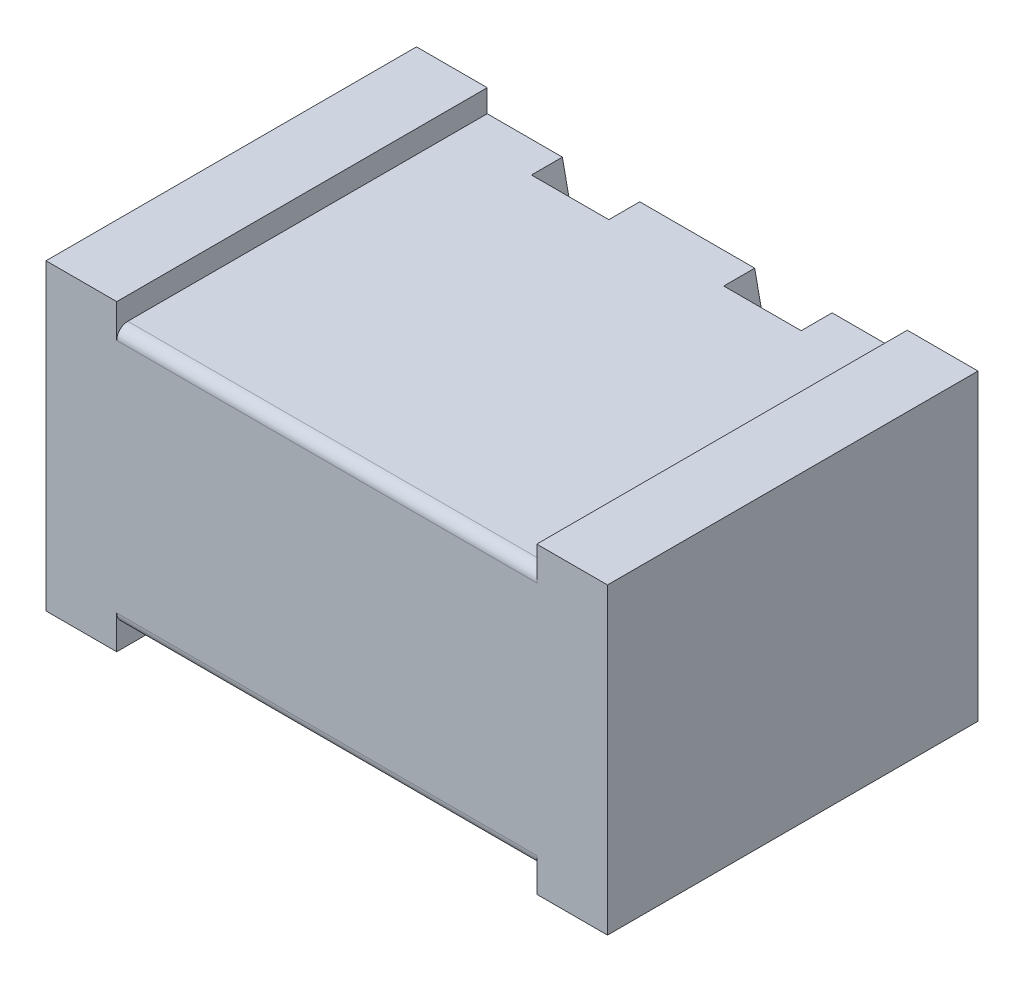
ISO-10303-21;
HEADER;
FILE_DESCRIPTION(('STEP AP214'),'2;1');
FILE_NAME('part.step','',(''),(''),'','','');
FILE_SCHEMA(('AUTOMOTIVE_DESIGN { 1 0 10303 214 1 1 1 1 }'));
ENDSEC;
DATA;
#1=APPLICATION_CONTEXT('core data for automotive mechanical design processes');
#2=APPLICATION_PROTOCOL_DEFINITION('international standard','automotive_design',2000,#1);
#3=PRODUCT_CONTEXT('',#1,'mechanical');
#4=PRODUCT('Part','Part','',(#3));
#5=PRODUCT_RELATED_PRODUCT_CATEGORY('part','',(#4));
#6=PRODUCT_DEFINITION_FORMATION('','',#4);
#7=PRODUCT_DEFINITION_CONTEXT('part definition',#1,'design');
#8=PRODUCT_DEFINITION('design','',#6,#7);
#9=PRODUCT_DEFINITION_SHAPE('','',#8);
#10=(LENGTH_UNIT() NAMED_UNIT(*) SI_UNIT(.MILLI.,.METRE.));
#11=(NAMED_UNIT(*) PLANE_ANGLE_UNIT() SI_UNIT($,.RADIAN.));
#12=(NAMED_UNIT(*) SI_UNIT($,.STERADIAN.) SOLID_ANGLE_UNIT());
#13=UNCERTAINTY_MEASURE_WITH_UNIT(LENGTH_MEASURE(1.E-05),#10,'distance_accuracy_value','');
#14=(GEOMETRIC_REPRESENTATION_CONTEXT(3) GLOBAL_UNCERTAINTY_ASSIGNED_CONTEXT((#13)) GLOBAL_UNIT_ASSIGNED_CONTEXT((#10,
#11,#12)) REPRESENTATION_CONTEXT('',''));
#15=CARTESIAN_POINT('',(0.,0.,0.));
#16=DIRECTION('',(0.,0.,1.));
#17=DIRECTION('',(1.,0.,0.));
#18=AXIS2_PLACEMENT_3D('',#15,#16,#17);
#19=CARTESIAN_POINT('',(2.37499999999999,-2.67,8.13));
#20=DIRECTION('',(-1.,0.,0.));
#21=DIRECTION('',(0.,-1.,0.));
#22=AXIS2_PLACEMENT_3D('',#19,#20,#21);
#23=CYLINDRICAL_SURFACE('',#22,0.25);
#24=CARTESIAN_POINT('',(-4.74999999999999,-2.67000000000001,8.13));
#25=DIRECTION('',(-1.,0.,0.));
#26=DIRECTION('',(0.,-1.,0.));
#27=AXIS2_PLACEMENT_3D('',#24,#25,#26);
#28=CIRCLE('',#27,0.25);
#29=CARTESIAN_POINT('',(-4.74999999999999,-2.91999999999999,8.13));
#30=VERTEX_POINT('',#29);
#31=CARTESIAN_POINT('',(-4.74999999999999,-2.67000000000001,8.38));
#32=VERTEX_POINT('',#31);
#33=EDGE_CURVE('E19',#30,#32,#28,.T.);
#34=ORIENTED_EDGE('',*,*,#33,.F.);
#35=DIRECTION('',(1.,0.,0.));
#36=VECTOR('',#35,1.);
#37=CARTESIAN_POINT('',(4.74999999999998,-2.91999999999999,8.13));
#38=LINE('',#37,#36);
#39=CARTESIAN_POINT('',(4.74999999999998,-2.91999999999999,8.13));
#40=VERTEX_POINT('',#39);
#41=EDGE_CURVE('E202',#40,#30,#38,.F.);
#42=ORIENTED_EDGE('',*,*,#41,.F.);
#43=CARTESIAN_POINT('',(4.74999999999998,-2.66999999999999,8.13));
#44=DIRECTION('',(-1.,0.,0.));
#45=DIRECTION('',(0.,-1.,0.));
#46=AXIS2_PLACEMENT_3D('',#43,#44,#45);
#47=CIRCLE('',#46,0.25);
#48=CARTESIAN_POINT('',(4.74999999999998,-2.67,8.38));
#49=VERTEX_POINT('',#48);
#50=EDGE_CURVE('E209',#49,#40,#47,.F.);
#51=ORIENTED_EDGE('',*,*,#50,.F.);
#52=DIRECTION('',(1.,0.,0.));
#53=VECTOR('',#52,1.);
#54=CARTESIAN_POINT('',(0.,-2.67000000000001,8.38));
#55=LINE('',#54,#53);
#56=EDGE_CURVE('E205',#32,#49,#55,.T.);
#57=ORIENTED_EDGE('',*,*,#56,.F.);
#58=EDGE_LOOP('',(#34,#42,#51,#57));
#59=FACE_BOUND('',#58,.T.);
#60=ADVANCED_FACE('F16',(#59),#23,.T.);
#61=CARTESIAN_POINT('',(-4.74999999999999,-2.92000000000001,0.));
#62=DIRECTION('',(1.,0.,0.));
#63=DIRECTION('',(0.,0.,-1.));
#64=AXIS2_PLACEMENT_3D('',#61,#62,#63);
#65=PLANE('',#64);
#66=DIRECTION('',(0.,0.,-1.));
#67=VECTOR('',#66,1.);
#68=CARTESIAN_POINT('',(-4.74999999999999,-2.91999999999999,0.));
#69=LINE('',#68,#67);
#70=CARTESIAN_POINT('',(-4.74999999999999,-2.92,0.));
#71=VERTEX_POINT('',#70);
#72=EDGE_CURVE('E212',#30,#71,#69,.T.);
#73=ORIENTED_EDGE('',*,*,#72,.F.);
#74=ORIENTED_EDGE('',*,*,#33,.T.);
#75=DIRECTION('',(0.,1.,0.));
#76=VECTOR('',#75,1.);
#77=CARTESIAN_POINT('',(-4.74999999999999,0.,8.38));
#78=LINE('',#77,#76);
#79=CARTESIAN_POINT('',(-4.74999999999999,-3.43,8.38));
#80=VERTEX_POINT('',#79);
#81=EDGE_CURVE('E269',#80,#32,#78,.T.);
#82=ORIENTED_EDGE('',*,*,#81,.F.);
#83=DIRECTION('',(0.,0.,-1.));
#84=VECTOR('',#83,1.);
#85=CARTESIAN_POINT('',(-4.74999999999999,-3.43,0.));
#86=LINE('',#85,#84);
#87=CARTESIAN_POINT('',(-4.74999999999999,-3.43,0.));
#88=VERTEX_POINT('',#87);
#89=EDGE_CURVE('E288',#88,#80,#86,.F.);
#90=ORIENTED_EDGE('',*,*,#89,.F.);
#91=DIRECTION('',(0.,1.,0.));
#92=VECTOR('',#91,1.);
#93=CARTESIAN_POINT('',(-4.74999999999999,-2.92000000000001,0.));
#94=LINE('',#93,#92);
#95=EDGE_CURVE('E210',#88,#71,#94,.T.);
#96=ORIENTED_EDGE('',*,*,#95,.T.);
#97=EDGE_LOOP('',(#73,#74,#82,#90,#96));
#98=FACE_BOUND('',#97,.T.);
#99=ADVANCED_FACE('F213',(#98),#65,.T.);
#100=CARTESIAN_POINT('',(4.74999999999999,-3.42999999999999,0.));
#101=DIRECTION('',(-1.,0.,0.));
#102=DIRECTION('',(0.,0.,1.));
#103=AXIS2_PLACEMENT_3D('',#100,#101,#102);
#104=PLANE('',#103);
#105=DIRECTION('',(0.,1.,0.));
#106=VECTOR('',#105,1.);
#107=CARTESIAN_POINT('',(4.74999999999999,-3.42999999999999,0.));
#108=LINE('',#107,#106);
#109=CARTESIAN_POINT('',(4.74999999999999,-2.91999999999999,0.));
#110=VERTEX_POINT('',#109);
#111=CARTESIAN_POINT('',(4.74999999999999,-3.42999999999999,0.));
#112=VERTEX_POINT('',#111);
#113=EDGE_CURVE('E237',#110,#112,#108,.F.);
#114=ORIENTED_EDGE('',*,*,#113,.T.);
#115=DIRECTION('',(0.,0.,-1.));
#116=VECTOR('',#115,1.);
#117=CARTESIAN_POINT('',(4.74999999999999,-3.42999999999999,0.));
#118=LINE('',#117,#116);
#119=CARTESIAN_POINT('',(4.74999999999998,-3.42999999999999,8.38));
#120=VERTEX_POINT('',#119);
#121=EDGE_CURVE('E278',#120,#112,#118,.T.);
#122=ORIENTED_EDGE('',*,*,#121,.F.);
#123=DIRECTION('',(0.,1.,0.));
#124=VECTOR('',#123,1.);
#125=CARTESIAN_POINT('',(4.74999999999998,0.,8.38));
#126=LINE('',#125,#124);
#127=EDGE_CURVE('E268',#49,#120,#126,.F.);
#128=ORIENTED_EDGE('',*,*,#127,.F.);
#129=ORIENTED_EDGE('',*,*,#50,.T.);
#130=DIRECTION('',(0.,0.,-1.));
#131=VECTOR('',#130,1.);
#132=CARTESIAN_POINT('',(4.74999999999998,-2.91999999999999,0.));
#133=LINE('',#132,#131);
#134=EDGE_CURVE('E223',#110,#40,#133,.F.);
#135=ORIENTED_EDGE('',*,*,#134,.F.);
#136=EDGE_LOOP('',(#114,#122,#128,#129,#135));
#137=FACE_BOUND('',#136,.T.);
#138=ADVANCED_FACE('F347',(#137),#104,.T.);
#139=CARTESIAN_POINT('',(2.175,-2.34385391106059,0.7));
#140=DIRECTION('',(0.,0.,1.));
#141=DIRECTION('',(1.,0.,0.));
#142=AXIS2_PLACEMENT_3D('',#139,#140,#141);
#143=PLANE('',#142);
#144=DIRECTION('',(-0.20271265834639,-0.979238264237126,0.));
#145=VECTOR('',#144,1.);
#146=CARTESIAN_POINT('',(1.30000000000001,-2.92,0.7));
#147=LINE('',#146,#145);
#148=CARTESIAN_POINT('',(1.30000000000001,-2.92,0.7));
#149=VERTEX_POINT('',#148);
#150=CARTESIAN_POINT('',(1.4854453223527,-2.02417456387338,0.7));
#151=VERTEX_POINT('',#150);
#152=EDGE_CURVE('E396',#149,#151,#147,.F.);
#153=ORIENTED_EDGE('',*,*,#152,.T.);
#154=CARTESIAN_POINT('',(2.17499999999999,-2.16691966165606,0.7));
#155=DIRECTION('',(0.,0.,1.));
#156=DIRECTION('',(1.,0.,0.));
#157=AXIS2_PLACEMENT_3D('',#154,#155,#156);
#158=CIRCLE('',#157,0.704174563873369);
#159=CARTESIAN_POINT('',(2.86455467764727,-2.02417456387336,0.7));
#160=VERTEX_POINT('',#159);
#161=EDGE_CURVE('E341',#151,#160,#158,.F.);
#162=ORIENTED_EDGE('',*,*,#161,.T.);
#163=DIRECTION('',(-0.202712658346438,0.979238264237116,0.));
#164=VECTOR('',#163,1.);
#165=CARTESIAN_POINT('',(3.05000000000001,-2.92,0.7));
#166=LINE('',#165,#164);
#167=CARTESIAN_POINT('',(3.05000000000001,-2.92,0.7));
#168=VERTEX_POINT('',#167);
#169=EDGE_CURVE('E239',#168,#160,#166,.T.);
#170=ORIENTED_EDGE('',*,*,#169,.F.);
#171=DIRECTION('',(1.,0.,0.));
#172=VECTOR('',#171,1.);
#173=CARTESIAN_POINT('',(4.74999999999998,-2.91999999999999,0.7));
#174=LINE('',#173,#172);
#175=EDGE_CURVE('E371',#149,#168,#174,.T.);
#176=ORIENTED_EDGE('',*,*,#175,.F.);
#177=EDGE_LOOP('',(#153,#162,#170,#176));
#178=FACE_BOUND('',#177,.T.);
#179=ADVANCED_FACE('F587',(#178),#143,.F.);
#180=CARTESIAN_POINT('',(6.34999999999999,-3.42999999999999,0.));
#181=DIRECTION('',(0.,-1.,0.));
#182=DIRECTION('',(0.,0.,-1.));
#183=AXIS2_PLACEMENT_3D('',#180,#181,#182);
#184=PLANE('',#183);
#185=DIRECTION('',(1.,0.,0.));
#186=VECTOR('',#185,1.);
#187=CARTESIAN_POINT('',(6.34999999999999,-3.42999999999999,0.));
#188=LINE('',#187,#186);
#189=CARTESIAN_POINT('',(6.34999999999999,-3.42999999999999,0.));
#190=VERTEX_POINT('',#189);
#191=EDGE_CURVE('E281',#112,#190,#188,.T.);
#192=ORIENTED_EDGE('',*,*,#191,.T.);
#193=DIRECTION('',(0.,0.,-1.));
#194=VECTOR('',#193,1.);
#195=CARTESIAN_POINT('',(6.34999999999999,-3.42999999999999,0.));
#196=LINE('',#195,#194);
#197=CARTESIAN_POINT('',(6.34999999999999,-3.42999999999999,8.38));
#198=VERTEX_POINT('',#197);
#199=EDGE_CURVE('E251',#198,#190,#196,.T.);
#200=ORIENTED_EDGE('',*,*,#199,.F.);
#201=DIRECTION('',(1.,0.,0.));
#202=VECTOR('',#201,1.);
#203=CARTESIAN_POINT('',(0.,-3.42999999999999,8.38));
#204=LINE('',#203,#202);
#205=EDGE_CURVE('E272',#120,#198,#204,.T.);
#206=ORIENTED_EDGE('',*,*,#205,.F.);
#207=ORIENTED_EDGE('',*,*,#121,.T.);
#208=EDGE_LOOP('',(#192,#200,#206,#207));
#209=FACE_BOUND('',#208,.T.);
#210=ADVANCED_FACE('F589',(#209),#184,.T.);
#211=CARTESIAN_POINT('',(-4.74999999999999,-3.43,0.));
#212=DIRECTION('',(0.,-1.,0.));
#213=DIRECTION('',(0.,0.,-1.));
#214=AXIS2_PLACEMENT_3D('',#211,#212,#213);
#215=PLANE('',#214);
#216=DIRECTION('',(1.,0.,0.));
#217=VECTOR('',#216,1.);
#218=CARTESIAN_POINT('',(-4.74999999999999,-3.43,0.));
#219=LINE('',#218,#217);
#220=CARTESIAN_POINT('',(-6.34999999999999,-3.43,0.));
#221=VERTEX_POINT('',#220);
#222=EDGE_CURVE('E291',#221,#88,#219,.T.);
#223=ORIENTED_EDGE('',*,*,#222,.T.);
#224=ORIENTED_EDGE('',*,*,#89,.T.);
#225=DIRECTION('',(1.,0.,0.));
#226=VECTOR('',#225,1.);
#227=CARTESIAN_POINT('',(0.,-3.43,8.38));
#228=LINE('',#227,#226);
#229=CARTESIAN_POINT('',(-6.34999999999999,-3.43,8.38));
#230=VERTEX_POINT('',#229);
#231=EDGE_CURVE('E285',#230,#80,#228,.T.);
#232=ORIENTED_EDGE('',*,*,#231,.F.);
#233=DIRECTION('',(0.,0.,1.));
#234=VECTOR('',#233,1.);
#235=CARTESIAN_POINT('',(-6.34999999999999,-3.43,0.));
#236=LINE('',#235,#234);
#237=EDGE_CURVE('E357',#221,#230,#236,.T.);
#238=ORIENTED_EDGE('',*,*,#237,.F.);
#239=EDGE_LOOP('',(#223,#224,#232,#238));
#240=FACE_BOUND('',#239,.T.);
#241=ADVANCED_FACE('F355',(#240),#215,.T.);
#242=CARTESIAN_POINT('',(-2.17499999999993,-2.34385391106058,0.7));
#243=DIRECTION('',(0.,0.,1.));
#244=DIRECTION('',(1.,0.,0.));
#245=AXIS2_PLACEMENT_3D('',#242,#243,#244);
#246=PLANE('',#245);
#247=DIRECTION('',(-0.202712658346663,-0.97923826423707,0.));
#248=VECTOR('',#247,1.);
#249=CARTESIAN_POINT('',(-3.05000000000002,-2.91999999999989,0.7));
#250=LINE('',#249,#248);
#251=CARTESIAN_POINT('',(-3.05000000000002,-2.91999999999993,0.7));
#252=VERTEX_POINT('',#251);
#253=CARTESIAN_POINT('',(-2.86455467764709,-2.02417456387337,0.7));
#254=VERTEX_POINT('',#253);
#255=EDGE_CURVE('E448',#252,#254,#250,.F.);
#256=ORIENTED_EDGE('',*,*,#255,.T.);
#257=CARTESIAN_POINT('',(-2.17499999999982,-2.16691966165614,0.7));
#258=DIRECTION('',(0.,0.,1.));
#259=DIRECTION('',(1.,0.,0.));
#260=AXIS2_PLACEMENT_3D('',#257,#258,#259);
#261=CIRCLE('',#260,0.704174563873369);
#262=CARTESIAN_POINT('',(-1.48544532235266,-2.02417456387341,0.7));
#263=VERTEX_POINT('',#262);
#264=EDGE_CURVE('E336',#254,#263,#261,.F.);
#265=ORIENTED_EDGE('',*,*,#264,.T.);
#266=DIRECTION('',(-0.202712658346356,0.979238264237133,0.));
#267=VECTOR('',#266,1.);
#268=CARTESIAN_POINT('',(-1.30000000000002,-2.91999999999996,0.7));
#269=LINE('',#268,#267);
#270=CARTESIAN_POINT('',(-1.30000000000002,-2.91999999999995,0.7));
#271=VERTEX_POINT('',#270);
#272=EDGE_CURVE('E290',#271,#263,#269,.T.);
#273=ORIENTED_EDGE('',*,*,#272,.F.);
#274=DIRECTION('',(1.,0.,0.));
#275=VECTOR('',#274,1.);
#276=CARTESIAN_POINT('',(4.74999999999998,-2.91999999999999,0.7));
#277=LINE('',#276,#275);
#278=EDGE_CURVE('E368',#252,#271,#277,.T.);
#279=ORIENTED_EDGE('',*,*,#278,.F.);
#280=EDGE_LOOP('',(#256,#265,#273,#279));
#281=FACE_BOUND('',#280,.T.);
#282=ADVANCED_FACE('F689',(#281),#246,.F.);
#283=CARTESIAN_POINT('',(0.,0.,8.38));
#284=DIRECTION('',(0.,0.,1.));
#285=DIRECTION('',(1.,0.,0.));
#286=AXIS2_PLACEMENT_3D('',#283,#284,#285);
#287=PLANE('',#286);
#288=DIRECTION('',(0.,1.,0.));
#289=VECTOR('',#288,1.);
#290=CARTESIAN_POINT('',(6.34999999999999,3.43000000000001,8.38));
#291=LINE('',#290,#289);
#292=CARTESIAN_POINT('',(6.34999999999999,3.42999999999996,8.38));
#293=VERTEX_POINT('',#292);
#294=EDGE_CURVE('E261',#293,#198,#291,.F.);
#295=ORIENTED_EDGE('',*,*,#294,.F.);
#296=DIRECTION('',(1.,0.,0.));
#297=VECTOR('',#296,1.);
#298=CARTESIAN_POINT('',(4.74999999999999,3.42999999999991,8.38));
#299=LINE('',#298,#297);
#300=CARTESIAN_POINT('',(4.74999999999999,3.42999999999994,8.38));
#301=VERTEX_POINT('',#300);
#302=EDGE_CURVE('E226',#301,#293,#299,.T.);
#303=ORIENTED_EDGE('',*,*,#302,.F.);
#304=DIRECTION('',(0.,1.,0.));
#305=VECTOR('',#304,1.);
#306=CARTESIAN_POINT('',(4.74999999999999,0.,8.38));
#307=LINE('',#306,#305);
#308=CARTESIAN_POINT('',(4.74999999999999,2.66999999999991,8.38));
#309=VERTEX_POINT('',#308);
#310=EDGE_CURVE('E427',#301,#309,#307,.F.);
#311=ORIENTED_EDGE('',*,*,#310,.T.);
#312=DIRECTION('',(1.,0.,0.));
#313=VECTOR('',#312,1.);
#314=CARTESIAN_POINT('',(-2.37499999999999,2.66999999999996,8.38));
#315=LINE('',#314,#313);
#316=CARTESIAN_POINT('',(-4.74999999999999,2.66999999999998,8.38));
#317=VERTEX_POINT('',#316);
#318=EDGE_CURVE('E460',#317,#309,#315,.T.);
#319=ORIENTED_EDGE('',*,*,#318,.F.);
#320=DIRECTION('',(0.,1.,0.));
#321=VECTOR('',#320,1.);
#322=CARTESIAN_POINT('',(-4.74999999999999,0.,8.38));
#323=LINE('',#322,#321);
#324=CARTESIAN_POINT('',(-4.74999999999999,3.42999999999998,8.38));
#325=VERTEX_POINT('',#324);
#326=EDGE_CURVE('E380',#317,#325,#323,.T.);
#327=ORIENTED_EDGE('',*,*,#326,.T.);
#328=DIRECTION('',(1.,0.,0.));
#329=VECTOR('',#328,1.);
#330=CARTESIAN_POINT('',(-6.34999999999999,3.42999999999999,8.38));
#331=LINE('',#330,#329);
#332=CARTESIAN_POINT('',(-6.34999999999999,3.42999999999999,8.38));
#333=VERTEX_POINT('',#332);
#334=EDGE_CURVE('E437',#333,#325,#331,.T.);
#335=ORIENTED_EDGE('',*,*,#334,.F.);
#336=DIRECTION('',(0.,1.,0.));
#337=VECTOR('',#336,1.);
#338=CARTESIAN_POINT('',(-6.34999999999999,-3.43,8.38));
#339=LINE('',#338,#337);
#340=EDGE_CURVE('E250',#230,#333,#339,.T.);
#341=ORIENTED_EDGE('',*,*,#340,.F.);
#342=ORIENTED_EDGE('',*,*,#231,.T.);
#343=ORIENTED_EDGE('',*,*,#81,.T.);
#344=ORIENTED_EDGE('',*,*,#56,.T.);
#345=ORIENTED_EDGE('',*,*,#127,.T.);
#346=ORIENTED_EDGE('',*,*,#205,.T.);
#347=EDGE_LOOP('',(#295,#303,#311,#319,#327,#335,#341,#342,#343,#344,#345,#346));
#348=FACE_BOUND('',#347,.T.);
#349=ADVANCED_FACE('F350',(#348),#287,.T.);
#350=CARTESIAN_POINT('',(4.74999999999999,3.42999999999991,0.));
#351=DIRECTION('',(0.,1.,0.));
#352=DIRECTION('',(0.,0.,1.));
#353=AXIS2_PLACEMENT_3D('',#350,#351,#352);
#354=PLANE('',#353);
#355=DIRECTION('',(1.,0.,0.));
#356=VECTOR('',#355,1.);
#357=CARTESIAN_POINT('',(4.74999999999999,3.42999999999991,0.));
#358=LINE('',#357,#356);
#359=CARTESIAN_POINT('',(6.34999999999999,3.42999999999991,0.));
#360=VERTEX_POINT('',#359);
#361=CARTESIAN_POINT('',(4.74999999999999,3.42999999999994,0.));
#362=VERTEX_POINT('',#361);
#363=EDGE_CURVE('E224',#360,#362,#358,.F.);
#364=ORIENTED_EDGE('',*,*,#363,.T.);
#365=DIRECTION('',(0.,0.,1.));
#366=VECTOR('',#365,1.);
#367=CARTESIAN_POINT('',(4.74999999999999,3.42999999999991,0.));
#368=LINE('',#367,#366);
#369=EDGE_CURVE('E335',#301,#362,#368,.F.);
#370=ORIENTED_EDGE('',*,*,#369,.F.);
#371=ORIENTED_EDGE('',*,*,#302,.T.);
#372=DIRECTION('',(0.,0.,-1.));
#373=VECTOR('',#372,1.);
#374=CARTESIAN_POINT('',(6.34999999999999,3.43000000000001,0.));
#375=LINE('',#374,#373);
#376=EDGE_CURVE('E247',#360,#293,#375,.F.);
#377=ORIENTED_EDGE('',*,*,#376,.F.);
#378=EDGE_LOOP('',(#364,#370,#371,#377));
#379=FACE_BOUND('',#378,.T.);
#380=ADVANCED_FACE('F683',(#379),#354,.T.);
#381=CARTESIAN_POINT('',(4.74999999999998,-2.91999999999999,0.));
#382=DIRECTION('',(0.,-1.,0.));
#383=DIRECTION('',(0.,0.,-1.));
#384=AXIS2_PLACEMENT_3D('',#381,#382,#383);
#385=PLANE('',#384);
#386=DIRECTION('',(1.,0.,0.));
#387=VECTOR('',#386,1.);
#388=CARTESIAN_POINT('',(4.74999999999998,-2.91999999999999,0.));
#389=LINE('',#388,#387);
#390=CARTESIAN_POINT('',(3.05000000000001,-2.92,0.));
#391=VERTEX_POINT('',#390);
#392=EDGE_CURVE('E234',#391,#110,#389,.T.);
#393=ORIENTED_EDGE('',*,*,#392,.T.);
#394=ORIENTED_EDGE('',*,*,#134,.T.);
#395=ORIENTED_EDGE('',*,*,#41,.T.);
#396=ORIENTED_EDGE('',*,*,#72,.T.);
#397=DIRECTION('',(1.,0.,0.));
#398=VECTOR('',#397,1.);
#399=CARTESIAN_POINT('',(4.74999999999998,-2.91999999999999,0.));
#400=LINE('',#399,#398);
#401=CARTESIAN_POINT('',(-3.05000000000003,-2.91999999999996,0.));
#402=VERTEX_POINT('',#401);
#403=EDGE_CURVE('E217',#71,#402,#400,.T.);
#404=ORIENTED_EDGE('',*,*,#403,.T.);
#405=DIRECTION('',(0.,0.,1.));
#406=VECTOR('',#405,1.);
#407=CARTESIAN_POINT('',(-3.05000000000002,-2.91999999999989,0.));
#408=LINE('',#407,#406);
#409=EDGE_CURVE('E384',#402,#252,#408,.T.);
#410=ORIENTED_EDGE('',*,*,#409,.T.);
#411=ORIENTED_EDGE('',*,*,#278,.T.);
#412=DIRECTION('',(0.,0.,1.));
#413=VECTOR('',#412,1.);
#414=CARTESIAN_POINT('',(-1.30000000000002,-2.91999999999996,0.));
#415=LINE('',#414,#413);
#416=CARTESIAN_POINT('',(-1.30000000000002,-2.91999999999996,0.));
#417=VERTEX_POINT('',#416);
#418=EDGE_CURVE('E339',#271,#417,#415,.F.);
#419=ORIENTED_EDGE('',*,*,#418,.T.);
#420=DIRECTION('',(1.,0.,0.));
#421=VECTOR('',#420,1.);
#422=CARTESIAN_POINT('',(0.,-2.91999999999996,0.));
#423=LINE('',#422,#421);
#424=CARTESIAN_POINT('',(1.30000000000001,-2.91999999999997,0.));
#425=VERTEX_POINT('',#424);
#426=EDGE_CURVE('E410',#417,#425,#423,.T.);
#427=ORIENTED_EDGE('',*,*,#426,.T.);
#428=DIRECTION('',(0.,0.,1.));
#429=VECTOR('',#428,1.);
#430=CARTESIAN_POINT('',(1.30000000000001,-2.92,0.));
#431=LINE('',#430,#429);
#432=EDGE_CURVE('E233',#425,#149,#431,.T.);
#433=ORIENTED_EDGE('',*,*,#432,.T.);
#434=ORIENTED_EDGE('',*,*,#175,.T.);
#435=DIRECTION('',(0.,0.,1.));
#436=VECTOR('',#435,1.);
#437=CARTESIAN_POINT('',(3.05000000000001,-2.92,0.));
#438=LINE('',#437,#436);
#439=EDGE_CURVE('E343',#168,#391,#438,.F.);
#440=ORIENTED_EDGE('',*,*,#439,.T.);
#441=EDGE_LOOP('',(#393,#394,#395,#396,#404,#410,#411,#419,#427,#433,#434,#440));
#442=FACE_BOUND('',#441,.T.);
#443=ADVANCED_FACE('F221',(#442),#385,.T.);
#444=CARTESIAN_POINT('',(1.30000000000001,-2.92,0.));
#445=DIRECTION('',(-0.979238264237126,0.20271265834639,0.));
#446=DIRECTION('',(-0.20271265834639,-0.979238264237126,0.));
#447=AXIS2_PLACEMENT_3D('',#444,#445,#446);
#448=PLANE('',#447);
#449=ORIENTED_EDGE('',*,*,#432,.F.);
#450=DIRECTION('',(0.20271265834639,0.979238264237126,0.));
#451=VECTOR('',#450,1.);
#452=CARTESIAN_POINT('',(1.30000000000001,-2.92,0.));
#453=LINE('',#452,#451);
#454=CARTESIAN_POINT('',(1.4854453223527,-2.02417456387338,0.));
#455=VERTEX_POINT('',#454);
#456=EDGE_CURVE('E325',#425,#455,#453,.T.);
#457=ORIENTED_EDGE('',*,*,#456,.T.);
#458=DIRECTION('',(0.,0.,1.));
#459=VECTOR('',#458,1.);
#460=CARTESIAN_POINT('',(1.4854453223527,-2.02417456387337,0.));
#461=LINE('',#460,#459);
#462=EDGE_CURVE('E344',#455,#151,#461,.T.);
#463=ORIENTED_EDGE('',*,*,#462,.T.);
#464=ORIENTED_EDGE('',*,*,#152,.F.);
#465=EDGE_LOOP('',(#449,#457,#463,#464));
#466=FACE_BOUND('',#465,.T.);
#467=ADVANCED_FACE('F582',(#466),#448,.F.);
#468=CARTESIAN_POINT('',(2.17499999999999,-2.16691966165606,0.));
#469=DIRECTION('',(0.,0.,1.));
#470=DIRECTION('',(1.,0.,0.));
#471=AXIS2_PLACEMENT_3D('',#468,#469,#470);
#472=CYLINDRICAL_SURFACE('',#471,0.704174563873369);
#473=ORIENTED_EDGE('',*,*,#462,.F.);
#474=CARTESIAN_POINT('',(2.17499999999999,-2.16691966165606,0.));
#475=DIRECTION('',(0.,0.,1.));
#476=DIRECTION('',(1.,0.,0.));
#477=AXIS2_PLACEMENT_3D('',#474,#475,#476);
#478=CIRCLE('',#477,0.704174563873369);
#479=CARTESIAN_POINT('',(2.86455467764727,-2.02417456387336,0.));
#480=VERTEX_POINT('',#479);
#481=EDGE_CURVE('E323',#455,#480,#478,.F.);
#482=ORIENTED_EDGE('',*,*,#481,.T.);
#483=DIRECTION('',(0.,0.,1.));
#484=VECTOR('',#483,1.);
#485=CARTESIAN_POINT('',(2.86455467764727,-2.02417456387337,0.));
#486=LINE('',#485,#484);
#487=EDGE_CURVE('E264',#480,#160,#486,.T.);
#488=ORIENTED_EDGE('',*,*,#487,.T.);
#489=ORIENTED_EDGE('',*,*,#161,.F.);
#490=EDGE_LOOP('',(#473,#482,#488,#489));
#491=FACE_BOUND('',#490,.T.);
#492=ADVANCED_FACE('F585',(#491),#472,.F.);
#493=CARTESIAN_POINT('',(2.86455467764727,-2.02417456387337,0.));
#494=DIRECTION('',(0.979238264237117,0.202712658346436,0.));
#495=DIRECTION('',(-0.202712658346436,0.979238264237117,0.));
#496=AXIS2_PLACEMENT_3D('',#493,#494,#495);
#497=PLANE('',#496);
#498=ORIENTED_EDGE('',*,*,#487,.F.);
#499=DIRECTION('',(0.202712658346438,-0.979238264237116,0.));
#500=VECTOR('',#499,1.);
#501=CARTESIAN_POINT('',(2.86455467764727,-2.02417456387337,0.));
#502=LINE('',#501,#500);
#503=EDGE_CURVE('E258',#480,#391,#502,.T.);
#504=ORIENTED_EDGE('',*,*,#503,.T.);
#505=ORIENTED_EDGE('',*,*,#439,.F.);
#506=ORIENTED_EDGE('',*,*,#169,.T.);
#507=EDGE_LOOP('',(#498,#504,#505,#506));
#508=FACE_BOUND('',#507,.T.);
#509=ADVANCED_FACE('F494',(#508),#497,.F.);
#510=CARTESIAN_POINT('',(6.34999999999999,3.43000000000001,0.));
#511=DIRECTION('',(1.,0.,0.));
#512=DIRECTION('',(0.,0.,-1.));
#513=AXIS2_PLACEMENT_3D('',#510,#511,#512);
#514=PLANE('',#513);
#515=DIRECTION('',(0.,1.,0.));
#516=VECTOR('',#515,1.);
#517=CARTESIAN_POINT('',(6.34999999999999,0.,0.));
#518=LINE('',#517,#516);
#519=EDGE_CURVE('E254',#190,#360,#518,.T.);
#520=ORIENTED_EDGE('',*,*,#519,.T.);
#521=ORIENTED_EDGE('',*,*,#376,.T.);
#522=ORIENTED_EDGE('',*,*,#294,.T.);
#523=ORIENTED_EDGE('',*,*,#199,.T.);
#524=EDGE_LOOP('',(#520,#521,#522,#523));
#525=FACE_BOUND('',#524,.T.);
#526=ADVANCED_FACE('F670',(#525),#514,.T.);
#527=CARTESIAN_POINT('',(2.17499999999999,2.16691966165605,0.));
#528=DIRECTION('',(0.,0.,1.));
#529=DIRECTION('',(1.,0.,0.));
#530=AXIS2_PLACEMENT_3D('',#527,#528,#529);
#531=CYLINDRICAL_SURFACE('',#530,0.704174563873369);
#532=DIRECTION('',(0.,0.,1.));
#533=VECTOR('',#532,1.);
#534=CARTESIAN_POINT('',(2.86455467764728,2.02417456387335,0.));
#535=LINE('',#534,#533);
#536=CARTESIAN_POINT('',(2.86455467764727,2.02417456387334,0.7));
#537=VERTEX_POINT('',#536);
#538=CARTESIAN_POINT('',(2.86455467764727,2.02417456387334,0.));
#539=VERTEX_POINT('',#538);
#540=EDGE_CURVE('E334',#537,#539,#535,.F.);
#541=ORIENTED_EDGE('',*,*,#540,.T.);
#542=CARTESIAN_POINT('',(2.17499999999999,2.16691966165605,0.));
#543=DIRECTION('',(0.,0.,1.));
#544=DIRECTION('',(1.,0.,0.));
#545=AXIS2_PLACEMENT_3D('',#542,#543,#544);
#546=CIRCLE('',#545,0.704174563873369);
#547=CARTESIAN_POINT('',(1.4854453223527,2.02417456387336,0.));
#548=VERTEX_POINT('',#547);
#549=EDGE_CURVE('E320',#539,#548,#546,.F.);
#550=ORIENTED_EDGE('',*,*,#549,.T.);
#551=DIRECTION('',(0.,0.,1.));
#552=VECTOR('',#551,1.);
#553=CARTESIAN_POINT('',(1.4854453223527,2.02417456387335,0.));
#554=LINE('',#553,#552);
#555=CARTESIAN_POINT('',(1.4854453223527,2.02417456387336,0.7));
#556=VERTEX_POINT('',#555);
#557=EDGE_CURVE('E329',#548,#556,#554,.T.);
#558=ORIENTED_EDGE('',*,*,#557,.T.);
#559=CARTESIAN_POINT('',(2.17499999999999,2.16691966165605,0.7));
#560=DIRECTION('',(0.,0.,1.));
#561=DIRECTION('',(1.,0.,0.));
#562=AXIS2_PLACEMENT_3D('',#559,#560,#561);
#563=CIRCLE('',#562,0.704174563873369);
#564=EDGE_CURVE('E326',#556,#537,#563,.T.);
#565=ORIENTED_EDGE('',*,*,#564,.T.);
#566=EDGE_LOOP('',(#541,#550,#558,#565));
#567=FACE_BOUND('',#566,.T.);
#568=ADVANCED_FACE('F666',(#567),#531,.F.);
#569=CARTESIAN_POINT('',(-6.34999999999999,-3.43,0.));
#570=DIRECTION('',(-1.,0.,0.));
#571=DIRECTION('',(0.,0.,1.));
#572=AXIS2_PLACEMENT_3D('',#569,#570,#571);
#573=PLANE('',#572);
#574=DIRECTION('',(0.,1.,0.));
#575=VECTOR('',#574,1.);
#576=CARTESIAN_POINT('',(-6.34999999999999,0.,0.));
#577=LINE('',#576,#575);
#578=CARTESIAN_POINT('',(-6.34999999999999,3.42999999999998,0.));
#579=VERTEX_POINT('',#578);
#580=EDGE_CURVE('E364',#579,#221,#577,.F.);
#581=ORIENTED_EDGE('',*,*,#580,.T.);
#582=ORIENTED_EDGE('',*,*,#237,.T.);
#583=ORIENTED_EDGE('',*,*,#340,.T.);
#584=DIRECTION('',(0.,0.,1.));
#585=VECTOR('',#584,1.);
#586=CARTESIAN_POINT('',(-6.34999999999999,3.42999999999999,0.));
#587=LINE('',#586,#585);
#588=EDGE_CURVE('E440',#579,#333,#587,.T.);
#589=ORIENTED_EDGE('',*,*,#588,.F.);
#590=EDGE_LOOP('',(#581,#582,#583,#589));
#591=FACE_BOUND('',#590,.T.);
#592=ADVANCED_FACE('F662',(#591),#573,.T.);
#593=CARTESIAN_POINT('',(-3.05000000000002,-2.91999999999989,0.));
#594=DIRECTION('',(-0.97923826423707,0.202712658346663,0.));
#595=DIRECTION('',(-0.202712658346663,-0.97923826423707,0.));
#596=AXIS2_PLACEMENT_3D('',#593,#594,#595);
#597=PLANE('',#596);
#598=ORIENTED_EDGE('',*,*,#409,.F.);
#599=DIRECTION('',(0.202712658346662,0.97923826423707,0.));
#600=VECTOR('',#599,1.);
#601=CARTESIAN_POINT('',(-3.05000000000002,-2.91999999999989,0.));
#602=LINE('',#601,#600);
#603=CARTESIAN_POINT('',(-2.86455467764709,-2.02417456387337,0.));
#604=VERTEX_POINT('',#603);
#605=EDGE_CURVE('E315',#402,#604,#602,.T.);
#606=ORIENTED_EDGE('',*,*,#605,.T.);
#607=DIRECTION('',(0.,0.,1.));
#608=VECTOR('',#607,1.);
#609=CARTESIAN_POINT('',(-2.86455467764711,-2.02417456387347,0.));
#610=LINE('',#609,#608);
#611=EDGE_CURVE('E340',#604,#254,#610,.T.);
#612=ORIENTED_EDGE('',*,*,#611,.T.);
#613=ORIENTED_EDGE('',*,*,#255,.F.);
#614=EDGE_LOOP('',(#598,#606,#612,#613));
#615=FACE_BOUND('',#614,.T.);
#616=ADVANCED_FACE('F658',(#615),#597,.F.);
#617=CARTESIAN_POINT('',(-2.17499999999982,-2.16691966165614,0.));
#618=DIRECTION('',(0.,0.,1.));
#619=DIRECTION('',(1.,0.,0.));
#620=AXIS2_PLACEMENT_3D('',#617,#618,#619);
#621=CYLINDRICAL_SURFACE('',#620,0.704174563873369);
#622=ORIENTED_EDGE('',*,*,#611,.F.);
#623=CARTESIAN_POINT('',(-2.17499999999982,-2.16691966165614,0.));
#624=DIRECTION('',(0.,0.,1.));
#625=DIRECTION('',(1.,0.,0.));
#626=AXIS2_PLACEMENT_3D('',#623,#624,#625);
#627=CIRCLE('',#626,0.704174563873369);
#628=CARTESIAN_POINT('',(-1.48544532235266,-2.02417456387341,0.));
#629=VERTEX_POINT('',#628);
#630=EDGE_CURVE('E312',#604,#629,#627,.F.);
#631=ORIENTED_EDGE('',*,*,#630,.T.);
#632=DIRECTION('',(0.,0.,1.));
#633=VECTOR('',#632,1.);
#634=CARTESIAN_POINT('',(-1.48544532235268,-2.02417456387332,0.));
#635=LINE('',#634,#633);
#636=EDGE_CURVE('E554',#629,#263,#635,.T.);
#637=ORIENTED_EDGE('',*,*,#636,.T.);
#638=ORIENTED_EDGE('',*,*,#264,.F.);
#639=EDGE_LOOP('',(#622,#631,#637,#638));
#640=FACE_BOUND('',#639,.T.);
#641=ADVANCED_FACE('F654',(#640),#621,.F.);
#642=CARTESIAN_POINT('',(-1.48544532235268,-2.02417456387332,0.));
#643=DIRECTION('',(0.979238264237133,0.202712658346356,0.));
#644=DIRECTION('',(-0.202712658346356,0.979238264237133,0.));
#645=AXIS2_PLACEMENT_3D('',#642,#643,#644);
#646=PLANE('',#645);
#647=ORIENTED_EDGE('',*,*,#636,.F.);
#648=DIRECTION('',(0.202712658346356,-0.979238264237133,0.));
#649=VECTOR('',#648,1.);
#650=CARTESIAN_POINT('',(-1.48544532235268,-2.02417456387332,0.));
#651=LINE('',#650,#649);
#652=EDGE_CURVE('E314',#629,#417,#651,.T.);
#653=ORIENTED_EDGE('',*,*,#652,.T.);
#654=ORIENTED_EDGE('',*,*,#418,.F.);
#655=ORIENTED_EDGE('',*,*,#272,.T.);
#656=EDGE_LOOP('',(#647,#653,#654,#655));
#657=FACE_BOUND('',#656,.T.);
#658=ADVANCED_FACE('F650',(#657),#646,.F.);
#659=CARTESIAN_POINT('',(-2.17499999999982,2.16691966165612,0.));
#660=DIRECTION('',(0.,0.,1.));
#661=DIRECTION('',(1.,0.,0.));
#662=AXIS2_PLACEMENT_3D('',#659,#660,#661);
#663=CYLINDRICAL_SURFACE('',#662,0.704174563873369);
#664=DIRECTION('',(0.,0.,1.));
#665=VECTOR('',#664,1.);
#666=CARTESIAN_POINT('',(-1.48544532235268,2.0241745638733,0.));
#667=LINE('',#666,#665);
#668=CARTESIAN_POINT('',(-1.48544532235266,2.02417456387339,0.7));
#669=VERTEX_POINT('',#668);
#670=CARTESIAN_POINT('',(-1.48544532235266,2.02417456387339,0.));
#671=VERTEX_POINT('',#670);
#672=EDGE_CURVE('E555',#669,#671,#667,.F.);
#673=ORIENTED_EDGE('',*,*,#672,.T.);
#674=CARTESIAN_POINT('',(-2.17499999999982,2.16691966165612,0.));
#675=DIRECTION('',(0.,0.,1.));
#676=DIRECTION('',(1.,0.,0.));
#677=AXIS2_PLACEMENT_3D('',#674,#675,#676);
#678=CIRCLE('',#677,0.704174563873369);
#679=CARTESIAN_POINT('',(-2.86455467764709,2.02417456387335,0.));
#680=VERTEX_POINT('',#679);
#681=EDGE_CURVE('E316',#671,#680,#678,.F.);
#682=ORIENTED_EDGE('',*,*,#681,.T.);
#683=DIRECTION('',(0.,0.,1.));
#684=VECTOR('',#683,1.);
#685=CARTESIAN_POINT('',(-2.86455467764711,2.02417456387345,0.));
#686=LINE('',#685,#684);
#687=CARTESIAN_POINT('',(-2.86455467764709,2.02417456387335,0.7));
#688=VERTEX_POINT('',#687);
#689=EDGE_CURVE('E441',#688,#680,#686,.F.);
#690=ORIENTED_EDGE('',*,*,#689,.F.);
#691=CARTESIAN_POINT('',(-2.17499999999982,2.16691966165612,0.7));
#692=DIRECTION('',(0.,0.,1.));
#693=DIRECTION('',(1.,0.,0.));
#694=AXIS2_PLACEMENT_3D('',#691,#692,#693);
#695=CIRCLE('',#694,0.704174563873369);
#696=EDGE_CURVE('E307',#688,#669,#695,.T.);
#697=ORIENTED_EDGE('',*,*,#696,.T.);
#698=EDGE_LOOP('',(#673,#682,#690,#697));
#699=FACE_BOUND('',#698,.T.);
#700=ADVANCED_FACE('F646',(#699),#663,.F.);
#701=CARTESIAN_POINT('',(-6.34999999999999,3.42999999999999,0.));
#702=DIRECTION('',(0.,1.,0.));
#703=DIRECTION('',(0.,0.,1.));
#704=AXIS2_PLACEMENT_3D('',#701,#702,#703);
#705=PLANE('',#704);
#706=DIRECTION('',(1.,0.,0.));
#707=VECTOR('',#706,1.);
#708=CARTESIAN_POINT('',(0.,3.42999999999998,0.));
#709=LINE('',#708,#707);
#710=CARTESIAN_POINT('',(-4.74999999999999,3.42999999999998,0.));
#711=VERTEX_POINT('',#710);
#712=EDGE_CURVE('E464',#711,#579,#709,.F.);
#713=ORIENTED_EDGE('',*,*,#712,.T.);
#714=ORIENTED_EDGE('',*,*,#588,.T.);
#715=ORIENTED_EDGE('',*,*,#334,.T.);
#716=DIRECTION('',(0.,0.,-1.));
#717=VECTOR('',#716,1.);
#718=CARTESIAN_POINT('',(-4.74999999999999,3.42999999999998,0.));
#719=LINE('',#718,#717);
#720=EDGE_CURVE('E529',#711,#325,#719,.F.);
#721=ORIENTED_EDGE('',*,*,#720,.F.);
#722=EDGE_LOOP('',(#713,#714,#715,#721));
#723=FACE_BOUND('',#722,.T.);
#724=ADVANCED_FACE('F642',(#723),#705,.T.);
#725=CARTESIAN_POINT('',(-2.37499999999999,2.66999999999996,8.13));
#726=DIRECTION('',(1.,0.,0.));
#727=DIRECTION('',(0.,1.,0.));
#728=AXIS2_PLACEMENT_3D('',#725,#726,#727);
#729=CYLINDRICAL_SURFACE('',#728,0.25);
#730=CARTESIAN_POINT('',(4.74999999999999,2.66999999999991,8.13));
#731=DIRECTION('',(1.,0.,0.));
#732=DIRECTION('',(0.,1.,0.));
#733=AXIS2_PLACEMENT_3D('',#730,#731,#732);
#734=CIRCLE('',#733,0.25);
#735=CARTESIAN_POINT('',(4.74999999999999,2.91999999999998,8.13));
#736=VERTEX_POINT('',#735);
#737=EDGE_CURVE('E331',#736,#309,#734,.T.);
#738=ORIENTED_EDGE('',*,*,#737,.F.);
#739=DIRECTION('',(1.,0.,0.));
#740=VECTOR('',#739,1.);
#741=CARTESIAN_POINT('',(-4.74999999999999,2.91999999999998,8.13));
#742=LINE('',#741,#740);
#743=CARTESIAN_POINT('',(-4.74999999999999,2.91999999999998,8.13));
#744=VERTEX_POINT('',#743);
#745=EDGE_CURVE('E512',#744,#736,#742,.T.);
#746=ORIENTED_EDGE('',*,*,#745,.F.);
#747=CARTESIAN_POINT('',(-4.74999999999999,2.66999999999998,8.13));
#748=DIRECTION('',(1.,0.,0.));
#749=DIRECTION('',(0.,1.,0.));
#750=AXIS2_PLACEMENT_3D('',#747,#748,#749);
#751=CIRCLE('',#750,0.25);
#752=EDGE_CURVE('E302',#317,#744,#751,.F.);
#753=ORIENTED_EDGE('',*,*,#752,.F.);
#754=ORIENTED_EDGE('',*,*,#318,.T.);
#755=EDGE_LOOP('',(#738,#746,#753,#754));
#756=FACE_BOUND('',#755,.T.);
#757=ADVANCED_FACE('F638',(#756),#729,.T.);
#758=CARTESIAN_POINT('',(4.74999999999999,2.91999999999991,0.));
#759=DIRECTION('',(-1.,0.,0.));
#760=DIRECTION('',(0.,0.,1.));
#761=AXIS2_PLACEMENT_3D('',#758,#759,#760);
#762=PLANE('',#761);
#763=DIRECTION('',(0.,0.,1.));
#764=VECTOR('',#763,1.);
#765=CARTESIAN_POINT('',(4.74999999999999,2.91999999999998,0.));
#766=LINE('',#765,#764);
#767=CARTESIAN_POINT('',(4.74999999999999,2.91999999999998,0.));
#768=VERTEX_POINT('',#767);
#769=EDGE_CURVE('E509',#736,#768,#766,.F.);
#770=ORIENTED_EDGE('',*,*,#769,.F.);
#771=ORIENTED_EDGE('',*,*,#737,.T.);
#772=ORIENTED_EDGE('',*,*,#310,.F.);
#773=ORIENTED_EDGE('',*,*,#369,.T.);
#774=DIRECTION('',(0.,1.,0.));
#775=VECTOR('',#774,1.);
#776=CARTESIAN_POINT('',(4.74999999999999,0.,0.));
#777=LINE('',#776,#775);
#778=EDGE_CURVE('E257',#362,#768,#777,.F.);
#779=ORIENTED_EDGE('',*,*,#778,.T.);
#780=EDGE_LOOP('',(#770,#771,#772,#773,#779));
#781=FACE_BOUND('',#780,.T.);
#782=ADVANCED_FACE('F634',(#781),#762,.T.);
#783=CARTESIAN_POINT('',(3.05000000000001,2.91999999999998,0.));
#784=DIRECTION('',(0.979238264237117,-0.202712658346436,0.));
#785=DIRECTION('',(0.202712658346436,0.979238264237117,0.));
#786=AXIS2_PLACEMENT_3D('',#783,#784,#785);
#787=PLANE('',#786);
#788=DIRECTION('',(0.,0.,1.));
#789=VECTOR('',#788,1.);
#790=CARTESIAN_POINT('',(3.05000000000001,2.91999999999998,0.));
#791=LINE('',#790,#789);
#792=CARTESIAN_POINT('',(3.05,2.91999999999995,0.));
#793=VERTEX_POINT('',#792);
#794=CARTESIAN_POINT('',(3.05000000000001,2.91999999999998,0.7));
#795=VERTEX_POINT('',#794);
#796=EDGE_CURVE('E417',#793,#795,#791,.T.);
#797=ORIENTED_EDGE('',*,*,#796,.F.);
#798=DIRECTION('',(-0.202712658346437,-0.979238264237116,0.));
#799=VECTOR('',#798,1.);
#800=CARTESIAN_POINT('',(3.05000000000001,2.91999999999998,0.));
#801=LINE('',#800,#799);
#802=EDGE_CURVE('E322',#793,#539,#801,.T.);
#803=ORIENTED_EDGE('',*,*,#802,.T.);
#804=ORIENTED_EDGE('',*,*,#540,.F.);
#805=DIRECTION('',(0.202712658346437,0.979238264237116,0.));
#806=VECTOR('',#805,1.);
#807=CARTESIAN_POINT('',(2.86455467764727,2.02417456387335,0.7));
#808=LINE('',#807,#806);
#809=EDGE_CURVE('E330',#537,#795,#808,.T.);
#810=ORIENTED_EDGE('',*,*,#809,.T.);
#811=EDGE_LOOP('',(#797,#803,#804,#810));
#812=FACE_BOUND('',#811,.T.);
#813=ADVANCED_FACE('F630',(#812),#787,.F.);
#814=CARTESIAN_POINT('',(2.175,2.34385391106057,0.7));
#815=DIRECTION('',(0.,0.,1.));
#816=DIRECTION('',(1.,0.,0.));
#817=AXIS2_PLACEMENT_3D('',#814,#815,#816);
#818=PLANE('',#817);
#819=DIRECTION('',(0.20271265834639,-0.979238264237126,0.));
#820=VECTOR('',#819,1.);
#821=CARTESIAN_POINT('',(1.4854453223527,2.02417456387335,0.7));
#822=LINE('',#821,#820);
#823=CARTESIAN_POINT('',(1.30000000000001,2.91999999999998,0.7));
#824=VERTEX_POINT('',#823);
#825=EDGE_CURVE('E408',#556,#824,#822,.F.);
#826=ORIENTED_EDGE('',*,*,#825,.T.);
#827=DIRECTION('',(1.,0.,0.));
#828=VECTOR('',#827,1.);
#829=CARTESIAN_POINT('',(-4.74999999999999,2.91999999999998,0.7));
#830=LINE('',#829,#828);
#831=EDGE_CURVE('E413',#795,#824,#830,.F.);
#832=ORIENTED_EDGE('',*,*,#831,.F.);
#833=ORIENTED_EDGE('',*,*,#809,.F.);
#834=ORIENTED_EDGE('',*,*,#564,.F.);
#835=EDGE_LOOP('',(#826,#832,#833,#834));
#836=FACE_BOUND('',#835,.T.);
#837=ADVANCED_FACE('F626',(#836),#818,.F.);
#838=CARTESIAN_POINT('',(1.4854453223527,2.02417456387335,0.));
#839=DIRECTION('',(-0.979238264237126,-0.20271265834639,0.));
#840=DIRECTION('',(0.20271265834639,-0.979238264237126,0.));
#841=AXIS2_PLACEMENT_3D('',#838,#839,#840);
#842=PLANE('',#841);
#843=ORIENTED_EDGE('',*,*,#557,.F.);
#844=DIRECTION('',(-0.20271265834639,0.979238264237126,0.));
#845=VECTOR('',#844,1.);
#846=CARTESIAN_POINT('',(1.4854453223527,2.02417456387335,0.));
#847=LINE('',#846,#845);
#848=CARTESIAN_POINT('',(1.30000000000001,2.91999999999998,0.));
#849=VERTEX_POINT('',#848);
#850=EDGE_CURVE('E319',#548,#849,#847,.T.);
#851=ORIENTED_EDGE('',*,*,#850,.T.);
#852=DIRECTION('',(0.,0.,1.));
#853=VECTOR('',#852,1.);
#854=CARTESIAN_POINT('',(1.30000000000001,2.91999999999998,0.));
#855=LINE('',#854,#853);
#856=EDGE_CURVE('E416',#824,#849,#855,.F.);
#857=ORIENTED_EDGE('',*,*,#856,.F.);
#858=ORIENTED_EDGE('',*,*,#825,.F.);
#859=EDGE_LOOP('',(#843,#851,#857,#858));
#860=FACE_BOUND('',#859,.T.);
#861=ADVANCED_FACE('F623',(#860),#842,.F.);
#862=CARTESIAN_POINT('',(0.,0.,0.));
#863=DIRECTION('',(0.,0.,1.));
#864=DIRECTION('',(1.,0.,0.));
#865=AXIS2_PLACEMENT_3D('',#862,#863,#864);
#866=PLANE('',#865);
#867=ORIENTED_EDGE('',*,*,#630,.F.);
#868=ORIENTED_EDGE('',*,*,#605,.F.);
#869=ORIENTED_EDGE('',*,*,#403,.F.);
#870=ORIENTED_EDGE('',*,*,#95,.F.);
#871=ORIENTED_EDGE('',*,*,#222,.F.);
#872=ORIENTED_EDGE('',*,*,#580,.F.);
#873=ORIENTED_EDGE('',*,*,#712,.F.);
#874=DIRECTION('',(0.,1.,0.));
#875=VECTOR('',#874,1.);
#876=CARTESIAN_POINT('',(-4.74999999999999,3.42999999999998,0.));
#877=LINE('',#876,#875);
#878=CARTESIAN_POINT('',(-4.74999999999999,2.91999999999995,0.));
#879=VERTEX_POINT('',#878);
#880=EDGE_CURVE('E305',#879,#711,#877,.T.);
#881=ORIENTED_EDGE('',*,*,#880,.F.);
#882=DIRECTION('',(1.,0.,0.));
#883=VECTOR('',#882,1.);
#884=CARTESIAN_POINT('',(0.,2.91999999999987,0.));
#885=LINE('',#884,#883);
#886=CARTESIAN_POINT('',(-3.05000000000002,2.91999999999992,0.));
#887=VERTEX_POINT('',#886);
#888=EDGE_CURVE('E33',#887,#879,#885,.F.);
#889=ORIENTED_EDGE('',*,*,#888,.F.);
#890=DIRECTION('',(0.202712658346663,-0.97923826423707,0.));
#891=VECTOR('',#890,1.);
#892=CARTESIAN_POINT('',(-2.86455467764711,2.02417456387345,0.));
#893=LINE('',#892,#891);
#894=EDGE_CURVE('E310',#887,#680,#893,.T.);
#895=ORIENTED_EDGE('',*,*,#894,.T.);
#896=ORIENTED_EDGE('',*,*,#681,.F.);
#897=DIRECTION('',(0.202712658346356,0.979238264237133,0.));
#898=VECTOR('',#897,1.);
#899=CARTESIAN_POINT('',(-1.30000000000002,2.91999999999994,0.));
#900=LINE('',#899,#898);
#901=CARTESIAN_POINT('',(-1.30000000000001,2.91999999999998,0.));
#902=VERTEX_POINT('',#901);
#903=EDGE_CURVE('E557',#671,#902,#900,.T.);
#904=ORIENTED_EDGE('',*,*,#903,.T.);
#905=DIRECTION('',(1.,0.,0.));
#906=VECTOR('',#905,1.);
#907=CARTESIAN_POINT('',(-4.74999999999999,2.91999999999998,0.));
#908=LINE('',#907,#906);
#909=EDGE_CURVE('E470',#849,#902,#908,.F.);
#910=ORIENTED_EDGE('',*,*,#909,.F.);
#911=ORIENTED_EDGE('',*,*,#850,.F.);
#912=ORIENTED_EDGE('',*,*,#549,.F.);
#913=ORIENTED_EDGE('',*,*,#802,.F.);
#914=DIRECTION('',(1.,0.,0.));
#915=VECTOR('',#914,1.);
#916=CARTESIAN_POINT('',(-4.74999999999999,2.91999999999998,0.));
#917=LINE('',#916,#915);
#918=EDGE_CURVE('E476',#768,#793,#917,.F.);
#919=ORIENTED_EDGE('',*,*,#918,.F.);
#920=ORIENTED_EDGE('',*,*,#778,.F.);
#921=ORIENTED_EDGE('',*,*,#363,.F.);
#922=ORIENTED_EDGE('',*,*,#519,.F.);
#923=ORIENTED_EDGE('',*,*,#191,.F.);
#924=ORIENTED_EDGE('',*,*,#113,.F.);
#925=ORIENTED_EDGE('',*,*,#392,.F.);
#926=ORIENTED_EDGE('',*,*,#503,.F.);
#927=ORIENTED_EDGE('',*,*,#481,.F.);
#928=ORIENTED_EDGE('',*,*,#456,.F.);
#929=ORIENTED_EDGE('',*,*,#426,.F.);
#930=ORIENTED_EDGE('',*,*,#652,.F.);
#931=EDGE_LOOP('',(#867,#868,#869,#870,#871,#872,#873,#881,#889,#895,#896,#904,#910,#911,#912,
#913,#919,#920,#921,#922,#923,#924,#925,#926,#927,#928,#929,#930));
#932=FACE_BOUND('',#931,.T.);
#933=ADVANCED_FACE('F362',(#932),#866,.F.);
#934=CARTESIAN_POINT('',(-1.30000000000002,2.91999999999994,0.));
#935=DIRECTION('',(0.979238264237133,-0.202712658346356,0.));
#936=DIRECTION('',(0.202712658346356,0.979238264237133,0.));
#937=AXIS2_PLACEMENT_3D('',#934,#935,#936);
#938=PLANE('',#937);
#939=DIRECTION('',(0.,0.,1.));
#940=VECTOR('',#939,1.);
#941=CARTESIAN_POINT('',(-1.30000000000002,2.91999999999998,0.));
#942=LINE('',#941,#940);
#943=CARTESIAN_POINT('',(-1.30000000000002,2.91999999999996,0.7));
#944=VERTEX_POINT('',#943);
#945=EDGE_CURVE('E546',#902,#944,#942,.T.);
#946=ORIENTED_EDGE('',*,*,#945,.F.);
#947=ORIENTED_EDGE('',*,*,#903,.F.);
#948=ORIENTED_EDGE('',*,*,#672,.F.);
#949=DIRECTION('',(0.202712658346356,0.979238264237133,0.));
#950=VECTOR('',#949,1.);
#951=CARTESIAN_POINT('',(-1.48544532235268,2.0241745638733,0.7));
#952=LINE('',#951,#950);
#953=EDGE_CURVE('E311',#669,#944,#952,.T.);
#954=ORIENTED_EDGE('',*,*,#953,.T.);
#955=EDGE_LOOP('',(#946,#947,#948,#954));
#956=FACE_BOUND('',#955,.T.);
#957=ADVANCED_FACE('F616',(#956),#938,.F.);
#958=CARTESIAN_POINT('',(-2.17499999999993,2.34385391106057,0.7));
#959=DIRECTION('',(0.,0.,1.));
#960=DIRECTION('',(1.,0.,0.));
#961=AXIS2_PLACEMENT_3D('',#958,#959,#960);
#962=PLANE('',#961);
#963=DIRECTION('',(0.202712658346663,-0.97923826423707,0.));
#964=VECTOR('',#963,1.);
#965=CARTESIAN_POINT('',(-2.86455467764711,2.02417456387345,0.7));
#966=LINE('',#965,#964);
#967=CARTESIAN_POINT('',(-3.05000000000003,2.91999999999993,0.7));
#968=VERTEX_POINT('',#967);
#969=EDGE_CURVE('E306',#688,#968,#966,.F.);
#970=ORIENTED_EDGE('',*,*,#969,.T.);
#971=DIRECTION('',(1.,0.,0.));
#972=VECTOR('',#971,1.);
#973=CARTESIAN_POINT('',(-4.74999999999999,2.91999999999998,0.7));
#974=LINE('',#973,#972);
#975=EDGE_CURVE('E541',#944,#968,#974,.F.);
#976=ORIENTED_EDGE('',*,*,#975,.F.);
#977=ORIENTED_EDGE('',*,*,#953,.F.);
#978=ORIENTED_EDGE('',*,*,#696,.F.);
#979=EDGE_LOOP('',(#970,#976,#977,#978));
#980=FACE_BOUND('',#979,.T.);
#981=ADVANCED_FACE('F612',(#980),#962,.F.);
#982=CARTESIAN_POINT('',(-2.86455467764711,2.02417456387345,0.));
#983=DIRECTION('',(-0.97923826423707,-0.202712658346663,0.));
#984=DIRECTION('',(0.202712658346663,-0.97923826423707,0.));
#985=AXIS2_PLACEMENT_3D('',#982,#983,#984);
#986=PLANE('',#985);
#987=ORIENTED_EDGE('',*,*,#689,.T.);
#988=ORIENTED_EDGE('',*,*,#894,.F.);
#989=DIRECTION('',(0.,0.,1.));
#990=VECTOR('',#989,1.);
#991=CARTESIAN_POINT('',(-3.05000000000002,2.91999999999998,0.));
#992=LINE('',#991,#990);
#993=EDGE_CURVE('E25',#968,#887,#992,.F.);
#994=ORIENTED_EDGE('',*,*,#993,.F.);
#995=ORIENTED_EDGE('',*,*,#969,.F.);
#996=EDGE_LOOP('',(#987,#988,#994,#995));
#997=FACE_BOUND('',#996,.T.);
#998=ADVANCED_FACE('F606',(#997),#986,.F.);
#999=CARTESIAN_POINT('',(-4.74999999999999,3.42999999999998,0.));
#1000=DIRECTION('',(1.,0.,0.));
#1001=DIRECTION('',(0.,0.,-1.));
#1002=AXIS2_PLACEMENT_3D('',#999,#1000,#1001);
#1003=PLANE('',#1002);
#1004=ORIENTED_EDGE('',*,*,#880,.T.);
#1005=ORIENTED_EDGE('',*,*,#720,.T.);
#1006=ORIENTED_EDGE('',*,*,#326,.F.);
#1007=ORIENTED_EDGE('',*,*,#752,.T.);
#1008=DIRECTION('',(0.,0.,1.));
#1009=VECTOR('',#1008,1.);
#1010=CARTESIAN_POINT('',(-4.74999999999999,2.91999999999998,0.));
#1011=LINE('',#1010,#1009);
#1012=EDGE_CURVE('E11',#879,#744,#1011,.T.);
#1013=ORIENTED_EDGE('',*,*,#1012,.F.);
#1014=EDGE_LOOP('',(#1004,#1005,#1006,#1007,#1013));
#1015=FACE_BOUND('',#1014,.T.);
#1016=ADVANCED_FACE('F601',(#1015),#1003,.T.);
#1017=CARTESIAN_POINT('',(-4.74999999999999,2.91999999999998,0.));
#1018=DIRECTION('',(0.,1.,0.));
#1019=DIRECTION('',(0.,0.,1.));
#1020=AXIS2_PLACEMENT_3D('',#1017,#1018,#1019);
#1021=PLANE('',#1020);
#1022=ORIENTED_EDGE('',*,*,#888,.T.);
#1023=ORIENTED_EDGE('',*,*,#1012,.T.);
#1024=ORIENTED_EDGE('',*,*,#745,.T.);
#1025=ORIENTED_EDGE('',*,*,#769,.T.);
#1026=ORIENTED_EDGE('',*,*,#918,.T.);
#1027=ORIENTED_EDGE('',*,*,#796,.T.);
#1028=ORIENTED_EDGE('',*,*,#831,.T.);
#1029=ORIENTED_EDGE('',*,*,#856,.T.);
#1030=ORIENTED_EDGE('',*,*,#909,.T.);
#1031=ORIENTED_EDGE('',*,*,#945,.T.);
#1032=ORIENTED_EDGE('',*,*,#975,.T.);
#1033=ORIENTED_EDGE('',*,*,#993,.T.);
#1034=EDGE_LOOP('',(#1022,#1023,#1024,#1025,#1026,#1027,#1028,#1029,#1030,#1031,#1032,#1033));
#1035=FACE_BOUND('',#1034,.T.);
#1036=ADVANCED_FACE('F599',(#1035),#1021,.T.);
#1037=CLOSED_SHELL('',(#60,#99,#138,#179,#210,#241,#282,#349,#380,#443,#467,#492,#509,#526,#568,
#592,#616,#641,#658,#700,#724,#757,#782,#813,#837,#861,#933,#957,#981,#998,#1016,#1036));
#1038=MANIFOLD_SOLID_BREP('B1',#1037);
#1039=ADVANCED_BREP_SHAPE_REPRESENTATION('',(#18,#1038),#14);
#1040=SHAPE_DEFINITION_REPRESENTATION(#9,#1039);
ENDSEC;
END-ISO-10303-21;
